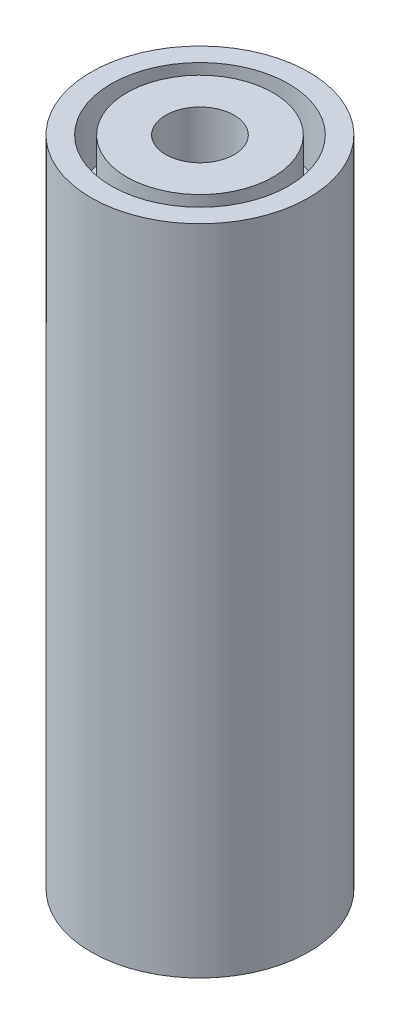
ISO-10303-21;
HEADER;
FILE_DESCRIPTION(('STEP AP214'),'2;1');
FILE_NAME('part.step','',(''),(''),'','','');
FILE_SCHEMA(('AUTOMOTIVE_DESIGN { 1 0 10303 214 1 1 1 1 }'));
ENDSEC;
DATA;
#1=APPLICATION_CONTEXT('core data for automotive mechanical design processes');
#2=APPLICATION_PROTOCOL_DEFINITION('international standard','automotive_design',2000,#1);
#3=PRODUCT_CONTEXT('',#1,'mechanical');
#4=PRODUCT('Part','Part','',(#3));
#5=PRODUCT_RELATED_PRODUCT_CATEGORY('part','',(#4));
#6=PRODUCT_DEFINITION_FORMATION('','',#4);
#7=PRODUCT_DEFINITION_CONTEXT('part definition',#1,'design');
#8=PRODUCT_DEFINITION('design','',#6,#7);
#9=PRODUCT_DEFINITION_SHAPE('','',#8);
#10=(LENGTH_UNIT() NAMED_UNIT(*) SI_UNIT(.MILLI.,.METRE.));
#11=(NAMED_UNIT(*) PLANE_ANGLE_UNIT() SI_UNIT($,.RADIAN.));
#12=(NAMED_UNIT(*) SI_UNIT($,.STERADIAN.) SOLID_ANGLE_UNIT());
#13=UNCERTAINTY_MEASURE_WITH_UNIT(LENGTH_MEASURE(1.E-05),#10,'distance_accuracy_value','');
#14=(GEOMETRIC_REPRESENTATION_CONTEXT(3) GLOBAL_UNCERTAINTY_ASSIGNED_CONTEXT((#13)) GLOBAL_UNIT_ASSIGNED_CONTEXT((#10,
#11,#12)) REPRESENTATION_CONTEXT('',''));
#15=CARTESIAN_POINT('',(0.,0.,0.));
#16=DIRECTION('',(0.,0.,1.));
#17=DIRECTION('',(1.,0.,0.));
#18=AXIS2_PLACEMENT_3D('',#15,#16,#17);
#19=CARTESIAN_POINT('',(0.,21.,0.));
#20=DIRECTION('',(0.,1.,0.));
#21=DIRECTION('',(0.,0.,1.));
#22=AXIS2_PLACEMENT_3D('',#19,#20,#21);
#23=PLANE('',#22);
#24=CARTESIAN_POINT('',(0.,21.,0.));
#25=DIRECTION('',(0.,1.,0.));
#26=DIRECTION('',(0.,0.,1.));
#27=AXIS2_PLACEMENT_3D('',#24,#25,#26);
#28=CIRCLE('',#27,1.1);
#29=CARTESIAN_POINT('',(0.,21.,1.1));
#30=VERTEX_POINT('',#29);
#31=EDGE_CURVE('E42',#30,#30,#28,.T.);
#32=ORIENTED_EDGE('',*,*,#31,.F.);
#33=EDGE_LOOP('',(#32));
#34=FACE_BOUND('',#33,.T.);
#35=CARTESIAN_POINT('',(0.,21.,0.));
#36=DIRECTION('',(0.,1.,0.));
#37=DIRECTION('',(0.,0.,1.));
#38=AXIS2_PLACEMENT_3D('',#35,#36,#37);
#39=CIRCLE('',#38,2.35);
#40=CARTESIAN_POINT('',(0.,21.,2.35));
#41=VERTEX_POINT('',#40);
#42=EDGE_CURVE('E56',#41,#41,#39,.T.);
#43=ORIENTED_EDGE('',*,*,#42,.T.);
#44=EDGE_LOOP('',(#43));
#45=FACE_BOUND('',#44,.T.);
#46=ADVANCED_FACE('F31',(#34,#45),#23,.T.);
#47=CARTESIAN_POINT('',(0.,21.,0.));
#48=DIRECTION('',(0.,1.,0.));
#49=DIRECTION('',(0.,0.,1.));
#50=AXIS2_PLACEMENT_3D('',#47,#48,#49);
#51=CIRCLE('',#50,2.85);
#52=CARTESIAN_POINT('',(0.,21.,2.85));
#53=VERTEX_POINT('',#52);
#54=EDGE_CURVE('E50',#53,#53,#51,.T.);
#55=ORIENTED_EDGE('',*,*,#54,.F.);
#56=EDGE_LOOP('',(#55));
#57=FACE_BOUND('',#56,.T.);
#58=CARTESIAN_POINT('',(0.,21.,0.));
#59=DIRECTION('',(0.,1.,0.));
#60=DIRECTION('',(0.,0.,1.));
#61=AXIS2_PLACEMENT_3D('',#58,#59,#60);
#62=CIRCLE('',#61,3.5);
#63=CARTESIAN_POINT('',(0.,21.,3.5));
#64=VERTEX_POINT('',#63);
#65=EDGE_CURVE('E10',#64,#64,#62,.T.);
#66=ORIENTED_EDGE('',*,*,#65,.T.);
#67=EDGE_LOOP('',(#66));
#68=FACE_BOUND('',#67,.T.);
#69=ADVANCED_FACE('F78',(#57,#68),#23,.T.);
#70=CARTESIAN_POINT('',(0.,0.,0.));
#71=DIRECTION('',(0.,1.,0.));
#72=DIRECTION('',(0.,0.,1.));
#73=AXIS2_PLACEMENT_3D('',#70,#71,#72);
#74=PLANE('',#73);
#75=CARTESIAN_POINT('',(0.,0.,0.));
#76=DIRECTION('',(0.,1.,0.));
#77=DIRECTION('',(0.,0.,1.));
#78=AXIS2_PLACEMENT_3D('',#75,#76,#77);
#79=CIRCLE('',#78,3.5);
#80=CARTESIAN_POINT('',(0.,0.,3.5));
#81=VERTEX_POINT('',#80);
#82=EDGE_CURVE('E35',#81,#81,#79,.T.);
#83=ORIENTED_EDGE('',*,*,#82,.F.);
#84=EDGE_LOOP('',(#83));
#85=FACE_BOUND('',#84,.T.);
#86=CARTESIAN_POINT('',(0.,0.,0.));
#87=DIRECTION('',(0.,1.,0.));
#88=DIRECTION('',(0.,0.,1.));
#89=AXIS2_PLACEMENT_3D('',#86,#87,#88);
#90=CIRCLE('',#89,1.1);
#91=CARTESIAN_POINT('',(0.,0.,1.1));
#92=VERTEX_POINT('',#91);
#93=EDGE_CURVE('E44',#92,#92,#90,.T.);
#94=ORIENTED_EDGE('',*,*,#93,.T.);
#95=EDGE_LOOP('',(#94));
#96=FACE_BOUND('',#95,.T.);
#97=ADVANCED_FACE('F80',(#85,#96),#74,.F.);
#98=CARTESIAN_POINT('',(0.,21.,0.));
#99=DIRECTION('',(0.,-1.,0.));
#100=DIRECTION('',(0.,0.,-1.));
#101=AXIS2_PLACEMENT_3D('',#98,#99,#100);
#102=CYLINDRICAL_SURFACE('',#101,3.5);
#103=ORIENTED_EDGE('',*,*,#65,.F.);
#104=EDGE_LOOP('',(#103));
#105=FACE_BOUND('',#104,.T.);
#106=ORIENTED_EDGE('',*,*,#82,.T.);
#107=EDGE_LOOP('',(#106));
#108=FACE_BOUND('',#107,.T.);
#109=ADVANCED_FACE('F33',(#105,#108),#102,.T.);
#110=CARTESIAN_POINT('',(0.,21.,0.));
#111=DIRECTION('',(0.,-1.,0.));
#112=DIRECTION('',(0.,0.,-1.));
#113=AXIS2_PLACEMENT_3D('',#110,#111,#112);
#114=CYLINDRICAL_SURFACE('',#113,1.1);
#115=ORIENTED_EDGE('',*,*,#31,.T.);
#116=EDGE_LOOP('',(#115));
#117=FACE_BOUND('',#116,.T.);
#118=ORIENTED_EDGE('',*,*,#93,.F.);
#119=EDGE_LOOP('',(#118));
#120=FACE_BOUND('',#119,.T.);
#121=ADVANCED_FACE('F74',(#117,#120),#114,.F.);
#122=CARTESIAN_POINT('',(0.,19.,0.));
#123=DIRECTION('',(0.,1.,0.));
#124=DIRECTION('',(0.,0.,1.));
#125=AXIS2_PLACEMENT_3D('',#122,#123,#124);
#126=CYLINDRICAL_SURFACE('',#125,2.85);
#127=CARTESIAN_POINT('',(0.,19.,0.));
#128=DIRECTION('',(0.,1.,0.));
#129=DIRECTION('',(0.,0.,1.));
#130=AXIS2_PLACEMENT_3D('',#127,#128,#129);
#131=CIRCLE('',#130,2.85);
#132=CARTESIAN_POINT('',(0.,19.,2.85));
#133=VERTEX_POINT('',#132);
#134=EDGE_CURVE('E47',#133,#133,#131,.T.);
#135=ORIENTED_EDGE('',*,*,#134,.F.);
#136=EDGE_LOOP('',(#135));
#137=FACE_BOUND('',#136,.T.);
#138=ORIENTED_EDGE('',*,*,#54,.T.);
#139=EDGE_LOOP('',(#138));
#140=FACE_BOUND('',#139,.T.);
#141=ADVANCED_FACE('F68',(#137,#140),#126,.F.);
#142=CARTESIAN_POINT('',(0.,19.,0.));
#143=DIRECTION('',(0.,1.,0.));
#144=DIRECTION('',(0.,0.,1.));
#145=AXIS2_PLACEMENT_3D('',#142,#143,#144);
#146=PLANE('',#145);
#147=CARTESIAN_POINT('',(0.,19.,0.));
#148=DIRECTION('',(0.,1.,0.));
#149=DIRECTION('',(0.,0.,1.));
#150=AXIS2_PLACEMENT_3D('',#147,#148,#149);
#151=CIRCLE('',#150,2.35);
#152=CARTESIAN_POINT('',(0.,19.,2.35));
#153=VERTEX_POINT('',#152);
#154=EDGE_CURVE('E53',#153,#153,#151,.T.);
#155=ORIENTED_EDGE('',*,*,#154,.F.);
#156=EDGE_LOOP('',(#155));
#157=FACE_BOUND('',#156,.T.);
#158=ORIENTED_EDGE('',*,*,#134,.T.);
#159=EDGE_LOOP('',(#158));
#160=FACE_BOUND('',#159,.T.);
#161=ADVANCED_FACE('F65',(#157,#160),#146,.T.);
#162=CARTESIAN_POINT('',(0.,19.,0.));
#163=DIRECTION('',(0.,1.,0.));
#164=DIRECTION('',(0.,0.,1.));
#165=AXIS2_PLACEMENT_3D('',#162,#163,#164);
#166=CYLINDRICAL_SURFACE('',#165,2.35);
#167=ORIENTED_EDGE('',*,*,#154,.T.);
#168=EDGE_LOOP('',(#167));
#169=FACE_BOUND('',#168,.T.);
#170=ORIENTED_EDGE('',*,*,#42,.F.);
#171=EDGE_LOOP('',(#170));
#172=FACE_BOUND('',#171,.T.);
#173=ADVANCED_FACE('F62',(#169,#172),#166,.T.);
#174=CLOSED_SHELL('',(#46,#69,#97,#109,#121,#141,#161,#173));
#175=MANIFOLD_SOLID_BREP('B2',#174);
#176=ADVANCED_BREP_SHAPE_REPRESENTATION('',(#18,#175),#14);
#177=SHAPE_DEFINITION_REPRESENTATION(#9,#176);
ENDSEC;
END-ISO-10303-21;
